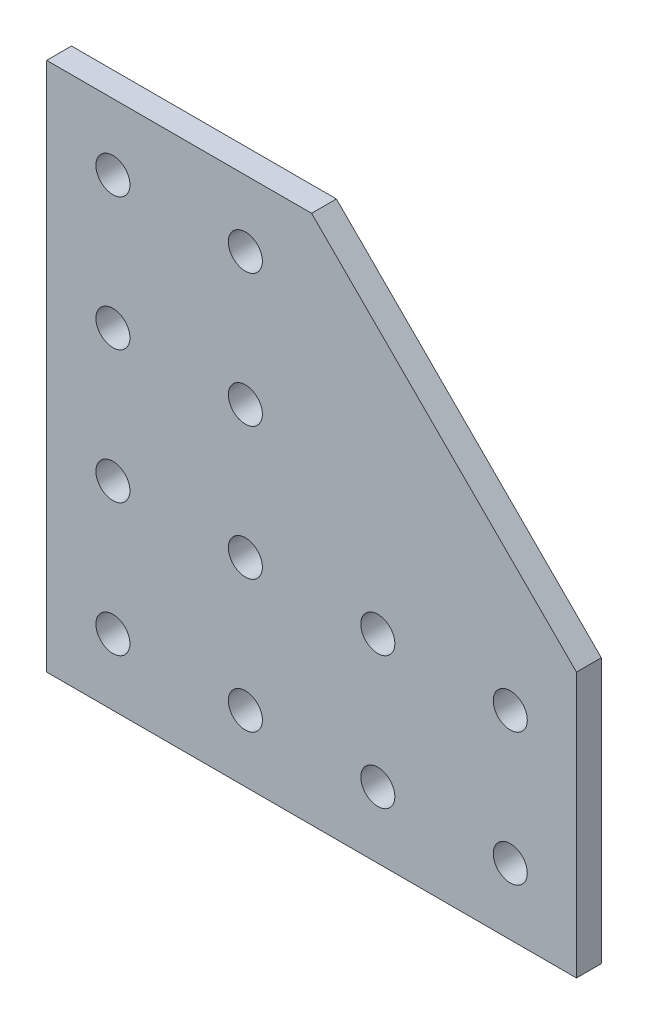
ISO-10303-21;
HEADER;
FILE_DESCRIPTION(('STEP AP214'),'2;1');
FILE_NAME('part.step','',(''),(''),'','','');
FILE_SCHEMA(('AUTOMOTIVE_DESIGN { 1 0 10303 214 1 1 1 1 }'));
ENDSEC;
DATA;
#1=APPLICATION_CONTEXT('core data for automotive mechanical design processes');
#2=APPLICATION_PROTOCOL_DEFINITION('international standard','automotive_design',2000,#1);
#3=PRODUCT_CONTEXT('',#1,'mechanical');
#4=PRODUCT('Part','Part','',(#3));
#5=PRODUCT_RELATED_PRODUCT_CATEGORY('part','',(#4));
#6=PRODUCT_DEFINITION_FORMATION('','',#4);
#7=PRODUCT_DEFINITION_CONTEXT('part definition',#1,'design');
#8=PRODUCT_DEFINITION('design','',#6,#7);
#9=PRODUCT_DEFINITION_SHAPE('','',#8);
#10=(LENGTH_UNIT() NAMED_UNIT(*) SI_UNIT(.MILLI.,.METRE.));
#11=(NAMED_UNIT(*) PLANE_ANGLE_UNIT() SI_UNIT($,.RADIAN.));
#12=(NAMED_UNIT(*) SI_UNIT($,.STERADIAN.) SOLID_ANGLE_UNIT());
#13=UNCERTAINTY_MEASURE_WITH_UNIT(LENGTH_MEASURE(1.E-05),#10,'distance_accuracy_value','');
#14=(GEOMETRIC_REPRESENTATION_CONTEXT(3) GLOBAL_UNCERTAINTY_ASSIGNED_CONTEXT((#13)) GLOBAL_UNIT_ASSIGNED_CONTEXT((#10,
#11,#12)) REPRESENTATION_CONTEXT('',''));
#15=CARTESIAN_POINT('',(0.,0.,0.));
#16=DIRECTION('',(0.,0.,1.));
#17=DIRECTION('',(1.,0.,0.));
#18=AXIS2_PLACEMENT_3D('',#15,#16,#17);
#19=CARTESIAN_POINT('',(0.,0.,2.38125));
#20=DIRECTION('',(0.,0.,-1.));
#21=DIRECTION('',(-1.,0.,0.));
#22=AXIS2_PLACEMENT_3D('',#19,#20,#21);
#23=PLANE('',#22);
#24=CARTESIAN_POINT('',(38.1,88.9,2.38125));
#25=DIRECTION('',(0.,0.,1.));
#26=DIRECTION('',(1.,0.,0.));
#27=AXIS2_PLACEMENT_3D('',#24,#25,#26);
#28=CIRCLE('',#27,3.2639);
#29=CARTESIAN_POINT('',(41.3639,88.9,2.38125));
#30=VERTEX_POINT('',#29);
#31=EDGE_CURVE('E214',#30,#30,#28,.T.);
#32=ORIENTED_EDGE('',*,*,#31,.F.);
#33=EDGE_LOOP('',(#32));
#34=FACE_BOUND('',#33,.T.);
#35=CARTESIAN_POINT('',(38.1,38.1,2.38125));
#36=DIRECTION('',(0.,0.,1.));
#37=DIRECTION('',(1.,0.,0.));
#38=AXIS2_PLACEMENT_3D('',#35,#36,#37);
#39=CIRCLE('',#38,3.2639);
#40=CARTESIAN_POINT('',(41.3639,38.1,2.38125));
#41=VERTEX_POINT('',#40);
#42=EDGE_CURVE('E226',#41,#41,#39,.T.);
#43=ORIENTED_EDGE('',*,*,#42,.F.);
#44=EDGE_LOOP('',(#43));
#45=FACE_BOUND('',#44,.T.);
#46=CARTESIAN_POINT('',(88.9,38.1,2.38125));
#47=DIRECTION('',(0.,0.,1.));
#48=DIRECTION('',(1.,0.,0.));
#49=AXIS2_PLACEMENT_3D('',#46,#47,#48);
#50=CIRCLE('',#49,3.2639);
#51=CARTESIAN_POINT('',(92.1639,38.1,2.38125));
#52=VERTEX_POINT('',#51);
#53=EDGE_CURVE('E238',#52,#52,#50,.T.);
#54=ORIENTED_EDGE('',*,*,#53,.F.);
#55=EDGE_LOOP('',(#54));
#56=FACE_BOUND('',#55,.T.);
#57=CARTESIAN_POINT('',(12.7,63.5,2.38125));
#58=DIRECTION('',(0.,0.,1.));
#59=DIRECTION('',(1.,0.,0.));
#60=AXIS2_PLACEMENT_3D('',#57,#58,#59);
#61=CIRCLE('',#60,3.2639);
#62=CARTESIAN_POINT('',(15.9639,63.5,2.38125));
#63=VERTEX_POINT('',#62);
#64=EDGE_CURVE('E250',#63,#63,#61,.T.);
#65=ORIENTED_EDGE('',*,*,#64,.F.);
#66=EDGE_LOOP('',(#65));
#67=FACE_BOUND('',#66,.T.);
#68=CARTESIAN_POINT('',(38.1,12.7,2.38125));
#69=DIRECTION('',(0.,0.,1.));
#70=DIRECTION('',(1.,0.,0.));
#71=AXIS2_PLACEMENT_3D('',#68,#69,#70);
#72=CIRCLE('',#71,3.26389999999999);
#73=CARTESIAN_POINT('',(41.3639,12.7,2.38125));
#74=VERTEX_POINT('',#73);
#75=EDGE_CURVE('E262',#74,#74,#72,.T.);
#76=ORIENTED_EDGE('',*,*,#75,.F.);
#77=EDGE_LOOP('',(#76));
#78=FACE_BOUND('',#77,.T.);
#79=CARTESIAN_POINT('',(88.9,12.7,2.38125));
#80=DIRECTION('',(0.,0.,1.));
#81=DIRECTION('',(1.,0.,0.));
#82=AXIS2_PLACEMENT_3D('',#79,#80,#81);
#83=CIRCLE('',#82,3.26389999999999);
#84=CARTESIAN_POINT('',(92.1639,12.7,2.38125));
#85=VERTEX_POINT('',#84);
#86=EDGE_CURVE('E121',#85,#85,#83,.T.);
#87=ORIENTED_EDGE('',*,*,#86,.F.);
#88=EDGE_LOOP('',(#87));
#89=FACE_BOUND('',#88,.T.);
#90=DIRECTION('',(1.,0.,0.));
#91=VECTOR('',#90,1.);
#92=CARTESIAN_POINT('',(101.6,0.,2.38125));
#93=LINE('',#92,#91);
#94=CARTESIAN_POINT('',(0.,0.,2.38125));
#95=VERTEX_POINT('',#94);
#96=CARTESIAN_POINT('',(101.6,0.,2.38125));
#97=VERTEX_POINT('',#96);
#98=EDGE_CURVE('E126',#95,#97,#93,.T.);
#99=ORIENTED_EDGE('',*,*,#98,.T.);
#100=DIRECTION('',(0.,1.,0.));
#101=VECTOR('',#100,1.);
#102=CARTESIAN_POINT('',(101.6,50.8,2.38125));
#103=LINE('',#102,#101);
#104=CARTESIAN_POINT('',(101.6,50.8,2.38125));
#105=VERTEX_POINT('',#104);
#106=EDGE_CURVE('E93',#97,#105,#103,.T.);
#107=ORIENTED_EDGE('',*,*,#106,.T.);
#108=DIRECTION('',(-0.707106781186547,0.707106781186547,0.));
#109=VECTOR('',#108,1.);
#110=CARTESIAN_POINT('',(101.6,50.8,2.38125));
#111=LINE('',#110,#109);
#112=CARTESIAN_POINT('',(50.8,101.6,2.38125));
#113=VERTEX_POINT('',#112);
#114=EDGE_CURVE('E97',#105,#113,#111,.T.);
#115=ORIENTED_EDGE('',*,*,#114,.T.);
#116=DIRECTION('',(-1.,0.,0.));
#117=VECTOR('',#116,1.);
#118=CARTESIAN_POINT('',(0.,101.6,2.38125));
#119=LINE('',#118,#117);
#120=CARTESIAN_POINT('',(0.,101.6,2.38125));
#121=VERTEX_POINT('',#120);
#122=EDGE_CURVE('E101',#113,#121,#119,.T.);
#123=ORIENTED_EDGE('',*,*,#122,.T.);
#124=DIRECTION('',(0.,-1.,0.));
#125=VECTOR('',#124,1.);
#126=CARTESIAN_POINT('',(0.,0.,2.38125));
#127=LINE('',#126,#125);
#128=EDGE_CURVE('E59',#121,#95,#127,.T.);
#129=ORIENTED_EDGE('',*,*,#128,.T.);
#130=EDGE_LOOP('',(#99,#107,#115,#123,#129));
#131=FACE_BOUND('',#130,.T.);
#132=CARTESIAN_POINT('',(12.7,12.7,2.38125));
#133=DIRECTION('',(0.,0.,1.));
#134=DIRECTION('',(1.,0.,0.));
#135=AXIS2_PLACEMENT_3D('',#132,#133,#134);
#136=CIRCLE('',#135,3.2639);
#137=CARTESIAN_POINT('',(15.9639,12.7,2.38125));
#138=VERTEX_POINT('',#137);
#139=EDGE_CURVE('E268',#138,#138,#136,.T.);
#140=ORIENTED_EDGE('',*,*,#139,.F.);
#141=EDGE_LOOP('',(#140));
#142=FACE_BOUND('',#141,.T.);
#143=CARTESIAN_POINT('',(63.5,12.7,2.38125));
#144=DIRECTION('',(0.,0.,1.));
#145=DIRECTION('',(1.,0.,0.));
#146=AXIS2_PLACEMENT_3D('',#143,#144,#145);
#147=CIRCLE('',#146,3.26389999999999);
#148=CARTESIAN_POINT('',(66.7639,12.7,2.38125));
#149=VERTEX_POINT('',#148);
#150=EDGE_CURVE('E256',#149,#149,#147,.T.);
#151=ORIENTED_EDGE('',*,*,#150,.F.);
#152=EDGE_LOOP('',(#151));
#153=FACE_BOUND('',#152,.T.);
#154=CARTESIAN_POINT('',(12.7,38.1,2.38125));
#155=DIRECTION('',(0.,0.,1.));
#156=DIRECTION('',(1.,0.,0.));
#157=AXIS2_PLACEMENT_3D('',#154,#155,#156);
#158=CIRCLE('',#157,3.26389999999999);
#159=CARTESIAN_POINT('',(15.9639,38.1,2.38125));
#160=VERTEX_POINT('',#159);
#161=EDGE_CURVE('E244',#160,#160,#158,.T.);
#162=ORIENTED_EDGE('',*,*,#161,.F.);
#163=EDGE_LOOP('',(#162));
#164=FACE_BOUND('',#163,.T.);
#165=CARTESIAN_POINT('',(63.5,38.1,2.38125));
#166=DIRECTION('',(0.,0.,1.));
#167=DIRECTION('',(1.,0.,0.));
#168=AXIS2_PLACEMENT_3D('',#165,#166,#167);
#169=CIRCLE('',#168,3.2639);
#170=CARTESIAN_POINT('',(66.7639,38.1,2.38125));
#171=VERTEX_POINT('',#170);
#172=EDGE_CURVE('E232',#171,#171,#169,.T.);
#173=ORIENTED_EDGE('',*,*,#172,.F.);
#174=EDGE_LOOP('',(#173));
#175=FACE_BOUND('',#174,.T.);
#176=CARTESIAN_POINT('',(12.7,88.9,2.38125));
#177=DIRECTION('',(0.,0.,1.));
#178=DIRECTION('',(1.,0.,0.));
#179=AXIS2_PLACEMENT_3D('',#176,#177,#178);
#180=CIRCLE('',#179,3.2639);
#181=CARTESIAN_POINT('',(15.9639,88.9,2.38125));
#182=VERTEX_POINT('',#181);
#183=EDGE_CURVE('E220',#182,#182,#180,.T.);
#184=ORIENTED_EDGE('',*,*,#183,.F.);
#185=EDGE_LOOP('',(#184));
#186=FACE_BOUND('',#185,.T.);
#187=CARTESIAN_POINT('',(38.1,63.5,2.38125));
#188=DIRECTION('',(0.,0.,1.));
#189=DIRECTION('',(1.,0.,0.));
#190=AXIS2_PLACEMENT_3D('',#187,#188,#189);
#191=CIRCLE('',#190,3.2639);
#192=CARTESIAN_POINT('',(41.3639,63.5,2.38125));
#193=VERTEX_POINT('',#192);
#194=EDGE_CURVE('E205',#193,#193,#191,.T.);
#195=ORIENTED_EDGE('',*,*,#194,.F.);
#196=EDGE_LOOP('',(#195));
#197=FACE_BOUND('',#196,.T.);
#198=ADVANCED_FACE('F42',(#34,#45,#56,#67,#78,#89,#131,#142,#153,#164,#175,#186,#197),#23,.F.);
#199=CARTESIAN_POINT('',(0.,0.,-2.38125));
#200=DIRECTION('',(0.,0.,-1.));
#201=DIRECTION('',(-1.,0.,0.));
#202=AXIS2_PLACEMENT_3D('',#199,#200,#201);
#203=PLANE('',#202);
#204=CARTESIAN_POINT('',(38.1,88.9,-2.38125));
#205=DIRECTION('',(0.,0.,1.));
#206=DIRECTION('',(1.,0.,0.));
#207=AXIS2_PLACEMENT_3D('',#204,#205,#206);
#208=CIRCLE('',#207,3.2639);
#209=CARTESIAN_POINT('',(41.3639,88.9,-2.38125));
#210=VERTEX_POINT('',#209);
#211=EDGE_CURVE('E211',#210,#210,#208,.T.);
#212=ORIENTED_EDGE('',*,*,#211,.T.);
#213=EDGE_LOOP('',(#212));
#214=FACE_BOUND('',#213,.T.);
#215=CARTESIAN_POINT('',(38.1,38.1,-2.38125));
#216=DIRECTION('',(0.,0.,1.));
#217=DIRECTION('',(1.,0.,0.));
#218=AXIS2_PLACEMENT_3D('',#215,#216,#217);
#219=CIRCLE('',#218,3.2639);
#220=CARTESIAN_POINT('',(41.3639,38.1,-2.38125));
#221=VERTEX_POINT('',#220);
#222=EDGE_CURVE('E223',#221,#221,#219,.T.);
#223=ORIENTED_EDGE('',*,*,#222,.T.);
#224=EDGE_LOOP('',(#223));
#225=FACE_BOUND('',#224,.T.);
#226=CARTESIAN_POINT('',(88.9,38.1,-2.38125));
#227=DIRECTION('',(0.,0.,1.));
#228=DIRECTION('',(1.,0.,0.));
#229=AXIS2_PLACEMENT_3D('',#226,#227,#228);
#230=CIRCLE('',#229,3.2639);
#231=CARTESIAN_POINT('',(92.1639,38.1,-2.38125));
#232=VERTEX_POINT('',#231);
#233=EDGE_CURVE('E235',#232,#232,#230,.T.);
#234=ORIENTED_EDGE('',*,*,#233,.T.);
#235=EDGE_LOOP('',(#234));
#236=FACE_BOUND('',#235,.T.);
#237=CARTESIAN_POINT('',(12.7,63.5,-2.38125));
#238=DIRECTION('',(0.,0.,1.));
#239=DIRECTION('',(1.,0.,0.));
#240=AXIS2_PLACEMENT_3D('',#237,#238,#239);
#241=CIRCLE('',#240,3.2639);
#242=CARTESIAN_POINT('',(15.9639,63.5,-2.38125));
#243=VERTEX_POINT('',#242);
#244=EDGE_CURVE('E247',#243,#243,#241,.T.);
#245=ORIENTED_EDGE('',*,*,#244,.T.);
#246=EDGE_LOOP('',(#245));
#247=FACE_BOUND('',#246,.T.);
#248=CARTESIAN_POINT('',(38.1,12.7,-2.38125));
#249=DIRECTION('',(0.,0.,1.));
#250=DIRECTION('',(1.,0.,0.));
#251=AXIS2_PLACEMENT_3D('',#248,#249,#250);
#252=CIRCLE('',#251,3.26389999999999);
#253=CARTESIAN_POINT('',(41.3639,12.7,-2.38125));
#254=VERTEX_POINT('',#253);
#255=EDGE_CURVE('E259',#254,#254,#252,.T.);
#256=ORIENTED_EDGE('',*,*,#255,.T.);
#257=EDGE_LOOP('',(#256));
#258=FACE_BOUND('',#257,.T.);
#259=CARTESIAN_POINT('',(88.9,12.7,-2.38125));
#260=DIRECTION('',(0.,0.,1.));
#261=DIRECTION('',(1.,0.,0.));
#262=AXIS2_PLACEMENT_3D('',#259,#260,#261);
#263=CIRCLE('',#262,3.26389999999999);
#264=CARTESIAN_POINT('',(92.1639,12.7,-2.38125));
#265=VERTEX_POINT('',#264);
#266=EDGE_CURVE('E271',#265,#265,#263,.T.);
#267=ORIENTED_EDGE('',*,*,#266,.T.);
#268=EDGE_LOOP('',(#267));
#269=FACE_BOUND('',#268,.T.);
#270=DIRECTION('',(1.,0.,0.));
#271=VECTOR('',#270,1.);
#272=CARTESIAN_POINT('',(101.6,0.,-2.38125));
#273=LINE('',#272,#271);
#274=CARTESIAN_POINT('',(0.,0.,-2.38125));
#275=VERTEX_POINT('',#274);
#276=CARTESIAN_POINT('',(101.6,0.,-2.38125));
#277=VERTEX_POINT('',#276);
#278=EDGE_CURVE('E117',#275,#277,#273,.T.);
#279=ORIENTED_EDGE('',*,*,#278,.F.);
#280=DIRECTION('',(0.,-1.,0.));
#281=VECTOR('',#280,1.);
#282=CARTESIAN_POINT('',(0.,0.,-2.38125));
#283=LINE('',#282,#281);
#284=CARTESIAN_POINT('',(0.,101.6,-2.38125));
#285=VERTEX_POINT('',#284);
#286=EDGE_CURVE('E85',#285,#275,#283,.T.);
#287=ORIENTED_EDGE('',*,*,#286,.F.);
#288=DIRECTION('',(-1.,0.,0.));
#289=VECTOR('',#288,1.);
#290=CARTESIAN_POINT('',(0.,101.6,-2.38125));
#291=LINE('',#290,#289);
#292=CARTESIAN_POINT('',(50.8,101.6,-2.38125));
#293=VERTEX_POINT('',#292);
#294=EDGE_CURVE('E79',#293,#285,#291,.T.);
#295=ORIENTED_EDGE('',*,*,#294,.F.);
#296=DIRECTION('',(-0.707106781186547,0.707106781186547,0.));
#297=VECTOR('',#296,1.);
#298=CARTESIAN_POINT('',(101.6,50.8,-2.38125));
#299=LINE('',#298,#297);
#300=CARTESIAN_POINT('',(101.6,50.8,-2.38125));
#301=VERTEX_POINT('',#300);
#302=EDGE_CURVE('E108',#301,#293,#299,.T.);
#303=ORIENTED_EDGE('',*,*,#302,.F.);
#304=DIRECTION('',(0.,1.,0.));
#305=VECTOR('',#304,1.);
#306=CARTESIAN_POINT('',(101.6,50.8,-2.38125));
#307=LINE('',#306,#305);
#308=EDGE_CURVE('E120',#277,#301,#307,.T.);
#309=ORIENTED_EDGE('',*,*,#308,.F.);
#310=EDGE_LOOP('',(#279,#287,#295,#303,#309));
#311=FACE_BOUND('',#310,.T.);
#312=CARTESIAN_POINT('',(12.7,12.7,-2.38125));
#313=DIRECTION('',(0.,0.,1.));
#314=DIRECTION('',(1.,0.,0.));
#315=AXIS2_PLACEMENT_3D('',#312,#313,#314);
#316=CIRCLE('',#315,3.2639);
#317=CARTESIAN_POINT('',(15.9639,12.7,-2.38125));
#318=VERTEX_POINT('',#317);
#319=EDGE_CURVE('E265',#318,#318,#316,.T.);
#320=ORIENTED_EDGE('',*,*,#319,.T.);
#321=EDGE_LOOP('',(#320));
#322=FACE_BOUND('',#321,.T.);
#323=CARTESIAN_POINT('',(63.5,12.7,-2.38125));
#324=DIRECTION('',(0.,0.,1.));
#325=DIRECTION('',(1.,0.,0.));
#326=AXIS2_PLACEMENT_3D('',#323,#324,#325);
#327=CIRCLE('',#326,3.26389999999999);
#328=CARTESIAN_POINT('',(66.7639,12.7,-2.38125));
#329=VERTEX_POINT('',#328);
#330=EDGE_CURVE('E253',#329,#329,#327,.T.);
#331=ORIENTED_EDGE('',*,*,#330,.T.);
#332=EDGE_LOOP('',(#331));
#333=FACE_BOUND('',#332,.T.);
#334=CARTESIAN_POINT('',(12.7,38.1,-2.38125));
#335=DIRECTION('',(0.,0.,1.));
#336=DIRECTION('',(1.,0.,0.));
#337=AXIS2_PLACEMENT_3D('',#334,#335,#336);
#338=CIRCLE('',#337,3.26389999999999);
#339=CARTESIAN_POINT('',(15.9639,38.1,-2.38125));
#340=VERTEX_POINT('',#339);
#341=EDGE_CURVE('E241',#340,#340,#338,.T.);
#342=ORIENTED_EDGE('',*,*,#341,.T.);
#343=EDGE_LOOP('',(#342));
#344=FACE_BOUND('',#343,.T.);
#345=CARTESIAN_POINT('',(63.5,38.1,-2.38125));
#346=DIRECTION('',(0.,0.,1.));
#347=DIRECTION('',(1.,0.,0.));
#348=AXIS2_PLACEMENT_3D('',#345,#346,#347);
#349=CIRCLE('',#348,3.2639);
#350=CARTESIAN_POINT('',(66.7639,38.1,-2.38125));
#351=VERTEX_POINT('',#350);
#352=EDGE_CURVE('E229',#351,#351,#349,.T.);
#353=ORIENTED_EDGE('',*,*,#352,.T.);
#354=EDGE_LOOP('',(#353));
#355=FACE_BOUND('',#354,.T.);
#356=CARTESIAN_POINT('',(12.7,88.9,-2.38125));
#357=DIRECTION('',(0.,0.,1.));
#358=DIRECTION('',(1.,0.,0.));
#359=AXIS2_PLACEMENT_3D('',#356,#357,#358);
#360=CIRCLE('',#359,3.2639);
#361=CARTESIAN_POINT('',(15.9639,88.9,-2.38125));
#362=VERTEX_POINT('',#361);
#363=EDGE_CURVE('E217',#362,#362,#360,.T.);
#364=ORIENTED_EDGE('',*,*,#363,.T.);
#365=EDGE_LOOP('',(#364));
#366=FACE_BOUND('',#365,.T.);
#367=CARTESIAN_POINT('',(38.1,63.5,-2.38125));
#368=DIRECTION('',(0.,0.,1.));
#369=DIRECTION('',(1.,0.,0.));
#370=AXIS2_PLACEMENT_3D('',#367,#368,#369);
#371=CIRCLE('',#370,3.2639);
#372=CARTESIAN_POINT('',(41.3639,63.5,-2.38125));
#373=VERTEX_POINT('',#372);
#374=EDGE_CURVE('E208',#373,#373,#371,.T.);
#375=ORIENTED_EDGE('',*,*,#374,.T.);
#376=EDGE_LOOP('',(#375));
#377=FACE_BOUND('',#376,.T.);
#378=ADVANCED_FACE('F130',(#214,#225,#236,#247,#258,#269,#311,#322,#333,#344,#355,#366,#377),
#203,.T.);
#379=CARTESIAN_POINT('',(101.6,0.,2.38125));
#380=DIRECTION('',(0.,1.,0.));
#381=DIRECTION('',(-1.,0.,0.));
#382=AXIS2_PLACEMENT_3D('',#379,#380,#381);
#383=PLANE('',#382);
#384=ORIENTED_EDGE('',*,*,#278,.T.);
#385=DIRECTION('',(0.,0.,-1.));
#386=VECTOR('',#385,1.);
#387=CARTESIAN_POINT('',(101.6,0.,2.38125));
#388=LINE('',#387,#386);
#389=EDGE_CURVE('E13',#97,#277,#388,.T.);
#390=ORIENTED_EDGE('',*,*,#389,.F.);
#391=ORIENTED_EDGE('',*,*,#98,.F.);
#392=DIRECTION('',(0.,0.,-1.));
#393=VECTOR('',#392,1.);
#394=CARTESIAN_POINT('',(0.,0.,2.38125));
#395=LINE('',#394,#393);
#396=EDGE_CURVE('E113',#95,#275,#395,.T.);
#397=ORIENTED_EDGE('',*,*,#396,.T.);
#398=EDGE_LOOP('',(#384,#390,#391,#397));
#399=FACE_BOUND('',#398,.T.);
#400=ADVANCED_FACE('F44',(#399),#383,.F.);
#401=CARTESIAN_POINT('',(101.6,50.8,2.38125));
#402=DIRECTION('',(-1.,0.,0.));
#403=DIRECTION('',(0.,0.,1.));
#404=AXIS2_PLACEMENT_3D('',#401,#402,#403);
#405=PLANE('',#404);
#406=ORIENTED_EDGE('',*,*,#308,.T.);
#407=DIRECTION('',(0.,0.,-1.));
#408=VECTOR('',#407,1.);
#409=CARTESIAN_POINT('',(101.6,50.8,2.38125));
#410=LINE('',#409,#408);
#411=EDGE_CURVE('E51',#105,#301,#410,.T.);
#412=ORIENTED_EDGE('',*,*,#411,.F.);
#413=ORIENTED_EDGE('',*,*,#106,.F.);
#414=ORIENTED_EDGE('',*,*,#389,.T.);
#415=EDGE_LOOP('',(#406,#412,#413,#414));
#416=FACE_BOUND('',#415,.T.);
#417=ADVANCED_FACE('F391',(#416),#405,.F.);
#418=CARTESIAN_POINT('',(101.6,50.8,2.38125));
#419=DIRECTION('',(-0.707106781186547,-0.707106781186547,0.));
#420=DIRECTION('',(0.707106781186548,-0.707106781186548,0.));
#421=AXIS2_PLACEMENT_3D('',#418,#419,#420);
#422=PLANE('',#421);
#423=ORIENTED_EDGE('',*,*,#302,.T.);
#424=DIRECTION('',(0.,0.,-1.));
#425=VECTOR('',#424,1.);
#426=CARTESIAN_POINT('',(50.8,101.6,2.38125));
#427=LINE('',#426,#425);
#428=EDGE_CURVE('E105',#113,#293,#427,.T.);
#429=ORIENTED_EDGE('',*,*,#428,.F.);
#430=ORIENTED_EDGE('',*,*,#114,.F.);
#431=ORIENTED_EDGE('',*,*,#411,.T.);
#432=EDGE_LOOP('',(#423,#429,#430,#431));
#433=FACE_BOUND('',#432,.T.);
#434=ADVANCED_FACE('F106',(#433),#422,.F.);
#435=CARTESIAN_POINT('',(0.,101.6,2.38125));
#436=DIRECTION('',(0.,-1.,0.));
#437=DIRECTION('',(0.,0.,-1.));
#438=AXIS2_PLACEMENT_3D('',#435,#436,#437);
#439=PLANE('',#438);
#440=ORIENTED_EDGE('',*,*,#294,.T.);
#441=DIRECTION('',(0.,0.,-1.));
#442=VECTOR('',#441,1.);
#443=CARTESIAN_POINT('',(0.,101.6,2.38125));
#444=LINE('',#443,#442);
#445=EDGE_CURVE('E109',#121,#285,#444,.T.);
#446=ORIENTED_EDGE('',*,*,#445,.F.);
#447=ORIENTED_EDGE('',*,*,#122,.F.);
#448=ORIENTED_EDGE('',*,*,#428,.T.);
#449=EDGE_LOOP('',(#440,#446,#447,#448));
#450=FACE_BOUND('',#449,.T.);
#451=ADVANCED_FACE('F111',(#450),#439,.F.);
#452=CARTESIAN_POINT('',(0.,0.,2.38125));
#453=DIRECTION('',(1.,0.,0.));
#454=DIRECTION('',(0.,0.,-1.));
#455=AXIS2_PLACEMENT_3D('',#452,#453,#454);
#456=PLANE('',#455);
#457=ORIENTED_EDGE('',*,*,#286,.T.);
#458=ORIENTED_EDGE('',*,*,#396,.F.);
#459=ORIENTED_EDGE('',*,*,#128,.F.);
#460=ORIENTED_EDGE('',*,*,#445,.T.);
#461=EDGE_LOOP('',(#457,#458,#459,#460));
#462=FACE_BOUND('',#461,.T.);
#463=ADVANCED_FACE('F135',(#462),#456,.F.);
#464=CARTESIAN_POINT('',(88.9,12.7,2.38125));
#465=DIRECTION('',(0.,0.,-1.));
#466=DIRECTION('',(-1.,0.,0.));
#467=AXIS2_PLACEMENT_3D('',#464,#465,#466);
#468=CYLINDRICAL_SURFACE('',#467,3.26389999999999);
#469=ORIENTED_EDGE('',*,*,#86,.T.);
#470=EDGE_LOOP('',(#469));
#471=FACE_BOUND('',#470,.T.);
#472=ORIENTED_EDGE('',*,*,#266,.F.);
#473=EDGE_LOOP('',(#472));
#474=FACE_BOUND('',#473,.T.);
#475=ADVANCED_FACE('F137',(#471,#474),#468,.F.);
#476=CARTESIAN_POINT('',(12.7,12.7,2.38125));
#477=DIRECTION('',(0.,0.,-1.));
#478=DIRECTION('',(-1.,0.,0.));
#479=AXIS2_PLACEMENT_3D('',#476,#477,#478);
#480=CYLINDRICAL_SURFACE('',#479,3.2639);
#481=ORIENTED_EDGE('',*,*,#139,.T.);
#482=EDGE_LOOP('',(#481));
#483=FACE_BOUND('',#482,.T.);
#484=ORIENTED_EDGE('',*,*,#319,.F.);
#485=EDGE_LOOP('',(#484));
#486=FACE_BOUND('',#485,.T.);
#487=ADVANCED_FACE('F143',(#483,#486),#480,.F.);
#488=CARTESIAN_POINT('',(38.1,12.7,2.38125));
#489=DIRECTION('',(0.,0.,-1.));
#490=DIRECTION('',(-1.,0.,0.));
#491=AXIS2_PLACEMENT_3D('',#488,#489,#490);
#492=CYLINDRICAL_SURFACE('',#491,3.26389999999999);
#493=ORIENTED_EDGE('',*,*,#75,.T.);
#494=EDGE_LOOP('',(#493));
#495=FACE_BOUND('',#494,.T.);
#496=ORIENTED_EDGE('',*,*,#255,.F.);
#497=EDGE_LOOP('',(#496));
#498=FACE_BOUND('',#497,.T.);
#499=ADVANCED_FACE('F160',(#495,#498),#492,.F.);
#500=CARTESIAN_POINT('',(63.5,12.7,2.38125));
#501=DIRECTION('',(0.,0.,-1.));
#502=DIRECTION('',(-1.,0.,0.));
#503=AXIS2_PLACEMENT_3D('',#500,#501,#502);
#504=CYLINDRICAL_SURFACE('',#503,3.26389999999999);
#505=ORIENTED_EDGE('',*,*,#150,.T.);
#506=EDGE_LOOP('',(#505));
#507=FACE_BOUND('',#506,.T.);
#508=ORIENTED_EDGE('',*,*,#330,.F.);
#509=EDGE_LOOP('',(#508));
#510=FACE_BOUND('',#509,.T.);
#511=ADVANCED_FACE('F164',(#507,#510),#504,.F.);
#512=CARTESIAN_POINT('',(12.7,63.5,2.38125));
#513=DIRECTION('',(0.,0.,-1.));
#514=DIRECTION('',(-1.,0.,0.));
#515=AXIS2_PLACEMENT_3D('',#512,#513,#514);
#516=CYLINDRICAL_SURFACE('',#515,3.2639);
#517=ORIENTED_EDGE('',*,*,#64,.T.);
#518=EDGE_LOOP('',(#517));
#519=FACE_BOUND('',#518,.T.);
#520=ORIENTED_EDGE('',*,*,#244,.F.);
#521=EDGE_LOOP('',(#520));
#522=FACE_BOUND('',#521,.T.);
#523=ADVANCED_FACE('F168',(#519,#522),#516,.F.);
#524=CARTESIAN_POINT('',(12.7,38.1,2.38125));
#525=DIRECTION('',(0.,0.,-1.));
#526=DIRECTION('',(-1.,0.,0.));
#527=AXIS2_PLACEMENT_3D('',#524,#525,#526);
#528=CYLINDRICAL_SURFACE('',#527,3.26389999999999);
#529=ORIENTED_EDGE('',*,*,#161,.T.);
#530=EDGE_LOOP('',(#529));
#531=FACE_BOUND('',#530,.T.);
#532=ORIENTED_EDGE('',*,*,#341,.F.);
#533=EDGE_LOOP('',(#532));
#534=FACE_BOUND('',#533,.T.);
#535=ADVANCED_FACE('F172',(#531,#534),#528,.F.);
#536=CARTESIAN_POINT('',(88.9,38.1,2.38125));
#537=DIRECTION('',(0.,0.,-1.));
#538=DIRECTION('',(-1.,0.,0.));
#539=AXIS2_PLACEMENT_3D('',#536,#537,#538);
#540=CYLINDRICAL_SURFACE('',#539,3.2639);
#541=ORIENTED_EDGE('',*,*,#53,.T.);
#542=EDGE_LOOP('',(#541));
#543=FACE_BOUND('',#542,.T.);
#544=ORIENTED_EDGE('',*,*,#233,.F.);
#545=EDGE_LOOP('',(#544));
#546=FACE_BOUND('',#545,.T.);
#547=ADVANCED_FACE('F176',(#543,#546),#540,.F.);
#548=CARTESIAN_POINT('',(63.5,38.1,2.38125));
#549=DIRECTION('',(0.,0.,-1.));
#550=DIRECTION('',(-1.,0.,0.));
#551=AXIS2_PLACEMENT_3D('',#548,#549,#550);
#552=CYLINDRICAL_SURFACE('',#551,3.2639);
#553=ORIENTED_EDGE('',*,*,#172,.T.);
#554=EDGE_LOOP('',(#553));
#555=FACE_BOUND('',#554,.T.);
#556=ORIENTED_EDGE('',*,*,#352,.F.);
#557=EDGE_LOOP('',(#556));
#558=FACE_BOUND('',#557,.T.);
#559=ADVANCED_FACE('F180',(#555,#558),#552,.F.);
#560=CARTESIAN_POINT('',(38.1,38.1,2.38125));
#561=DIRECTION('',(0.,0.,-1.));
#562=DIRECTION('',(-1.,0.,0.));
#563=AXIS2_PLACEMENT_3D('',#560,#561,#562);
#564=CYLINDRICAL_SURFACE('',#563,3.2639);
#565=ORIENTED_EDGE('',*,*,#42,.T.);
#566=EDGE_LOOP('',(#565));
#567=FACE_BOUND('',#566,.T.);
#568=ORIENTED_EDGE('',*,*,#222,.F.);
#569=EDGE_LOOP('',(#568));
#570=FACE_BOUND('',#569,.T.);
#571=ADVANCED_FACE('F184',(#567,#570),#564,.F.);
#572=CARTESIAN_POINT('',(12.7,88.9,2.38125));
#573=DIRECTION('',(0.,0.,-1.));
#574=DIRECTION('',(-1.,0.,0.));
#575=AXIS2_PLACEMENT_3D('',#572,#573,#574);
#576=CYLINDRICAL_SURFACE('',#575,3.2639);
#577=ORIENTED_EDGE('',*,*,#183,.T.);
#578=EDGE_LOOP('',(#577));
#579=FACE_BOUND('',#578,.T.);
#580=ORIENTED_EDGE('',*,*,#363,.F.);
#581=EDGE_LOOP('',(#580));
#582=FACE_BOUND('',#581,.T.);
#583=ADVANCED_FACE('F188',(#579,#582),#576,.F.);
#584=CARTESIAN_POINT('',(38.1,88.9,2.38125));
#585=DIRECTION('',(0.,0.,-1.));
#586=DIRECTION('',(-1.,0.,0.));
#587=AXIS2_PLACEMENT_3D('',#584,#585,#586);
#588=CYLINDRICAL_SURFACE('',#587,3.2639);
#589=ORIENTED_EDGE('',*,*,#31,.T.);
#590=EDGE_LOOP('',(#589));
#591=FACE_BOUND('',#590,.T.);
#592=ORIENTED_EDGE('',*,*,#211,.F.);
#593=EDGE_LOOP('',(#592));
#594=FACE_BOUND('',#593,.T.);
#595=ADVANCED_FACE('F192',(#591,#594),#588,.F.);
#596=CARTESIAN_POINT('',(38.1,63.5,2.38125));
#597=DIRECTION('',(0.,0.,-1.));
#598=DIRECTION('',(-1.,0.,0.));
#599=AXIS2_PLACEMENT_3D('',#596,#597,#598);
#600=CYLINDRICAL_SURFACE('',#599,3.2639);
#601=ORIENTED_EDGE('',*,*,#194,.T.);
#602=EDGE_LOOP('',(#601));
#603=FACE_BOUND('',#602,.T.);
#604=ORIENTED_EDGE('',*,*,#374,.F.);
#605=EDGE_LOOP('',(#604));
#606=FACE_BOUND('',#605,.T.);
#607=ADVANCED_FACE('F196',(#603,#606),#600,.F.);
#608=CLOSED_SHELL('',(#198,#378,#400,#417,#434,#451,#463,#475,#487,#499,#511,#523,#535,#547,
#559,#571,#583,#595,#607));
#609=MANIFOLD_SOLID_BREP('B2',#608);
#610=ADVANCED_BREP_SHAPE_REPRESENTATION('',(#18,#609),#14);
#611=SHAPE_DEFINITION_REPRESENTATION(#9,#610);
ENDSEC;
END-ISO-10303-21;
